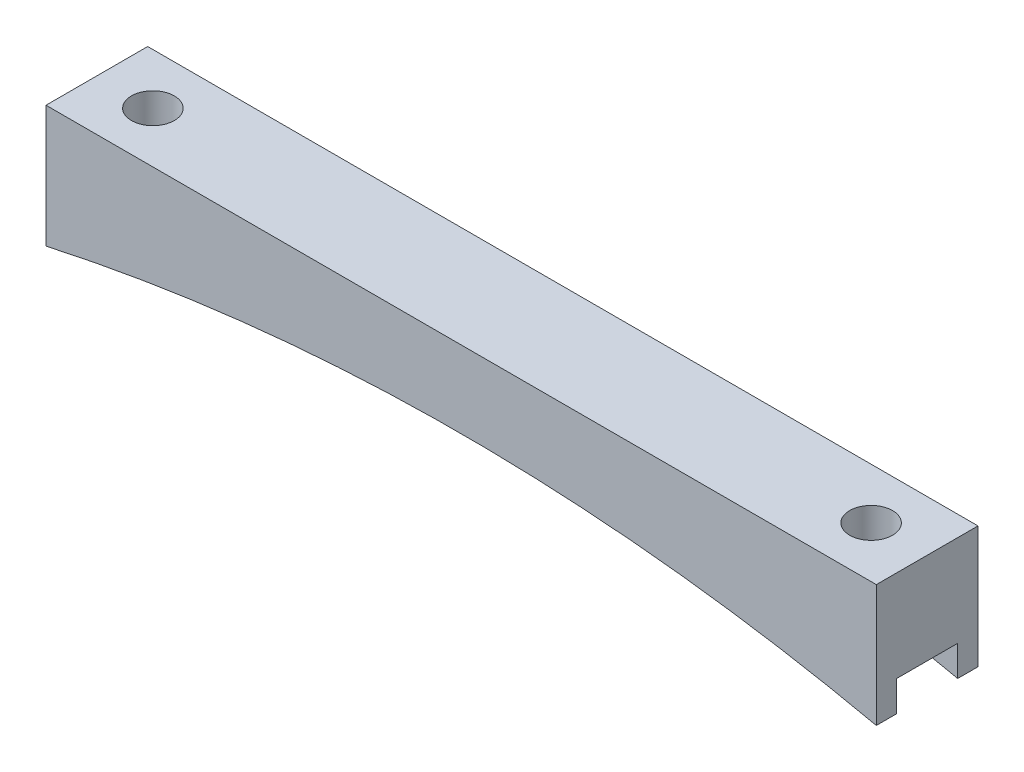
ISO-10303-21;
HEADER;
FILE_DESCRIPTION(('STEP AP214'),'2;1');
FILE_NAME('part.step','',(''),(''),'','','');
FILE_SCHEMA(('AUTOMOTIVE_DESIGN { 1 0 10303 214 1 1 1 1 }'));
ENDSEC;
DATA;
#1=APPLICATION_CONTEXT('core data for automotive mechanical design processes');
#2=APPLICATION_PROTOCOL_DEFINITION('international standard','automotive_design',2000,#1);
#3=PRODUCT_CONTEXT('',#1,'mechanical');
#4=PRODUCT('Part','Part','',(#3));
#5=PRODUCT_RELATED_PRODUCT_CATEGORY('part','',(#4));
#6=PRODUCT_DEFINITION_FORMATION('','',#4);
#7=PRODUCT_DEFINITION_CONTEXT('part definition',#1,'design');
#8=PRODUCT_DEFINITION('design','',#6,#7);
#9=PRODUCT_DEFINITION_SHAPE('','',#8);
#10=(LENGTH_UNIT() NAMED_UNIT(*) SI_UNIT(.MILLI.,.METRE.));
#11=(NAMED_UNIT(*) PLANE_ANGLE_UNIT() SI_UNIT($,.RADIAN.));
#12=(NAMED_UNIT(*) SI_UNIT($,.STERADIAN.) SOLID_ANGLE_UNIT());
#13=UNCERTAINTY_MEASURE_WITH_UNIT(LENGTH_MEASURE(1.E-05),#10,'distance_accuracy_value','');
#14=(GEOMETRIC_REPRESENTATION_CONTEXT(3) GLOBAL_UNCERTAINTY_ASSIGNED_CONTEXT((#13)) GLOBAL_UNIT_ASSIGNED_CONTEXT((#10,
#11,#12)) REPRESENTATION_CONTEXT('',''));
#15=CARTESIAN_POINT('',(0.,0.,0.));
#16=DIRECTION('',(0.,0.,1.));
#17=DIRECTION('',(1.,0.,0.));
#18=AXIS2_PLACEMENT_3D('',#15,#16,#17);
#19=CARTESIAN_POINT('',(51.855,0.,12.7));
#20=DIRECTION('',(-1.,0.,0.));
#21=DIRECTION('',(0.,0.,1.));
#22=AXIS2_PLACEMENT_3D('',#19,#20,#21);
#23=PLANE('',#22);
#24=DIRECTION('',(0.,0.,-1.));
#25=VECTOR('',#24,1.);
#26=CARTESIAN_POINT('',(51.855,-15.24,12.7));
#27=LINE('',#26,#25);
#28=CARTESIAN_POINT('',(51.855,-15.24,12.7));
#29=VERTEX_POINT('',#28);
#30=CARTESIAN_POINT('',(51.855,-15.24,10.16));
#31=VERTEX_POINT('',#30);
#32=EDGE_CURVE('E156',#29,#31,#27,.T.);
#33=ORIENTED_EDGE('',*,*,#32,.T.);
#34=DIRECTION('',(0.,-1.,0.));
#35=VECTOR('',#34,1.);
#36=CARTESIAN_POINT('',(51.855,-15.24,10.16));
#37=LINE('',#36,#35);
#38=CARTESIAN_POINT('',(51.855,-11.43,10.16));
#39=VERTEX_POINT('',#38);
#40=EDGE_CURVE('E185',#39,#31,#37,.T.);
#41=ORIENTED_EDGE('',*,*,#40,.F.);
#42=DIRECTION('',(0.,0.,1.));
#43=VECTOR('',#42,1.);
#44=CARTESIAN_POINT('',(51.855,-11.43,10.16));
#45=LINE('',#44,#43);
#46=CARTESIAN_POINT('',(51.855,-11.43,2.54));
#47=VERTEX_POINT('',#46);
#48=EDGE_CURVE('E141',#47,#39,#45,.T.);
#49=ORIENTED_EDGE('',*,*,#48,.F.);
#50=DIRECTION('',(0.,1.,0.));
#51=VECTOR('',#50,1.);
#52=CARTESIAN_POINT('',(51.855,-15.24,2.54));
#53=LINE('',#52,#51);
#54=CARTESIAN_POINT('',(51.855,-15.24,2.54));
#55=VERTEX_POINT('',#54);
#56=EDGE_CURVE('E177',#55,#47,#53,.T.);
#57=ORIENTED_EDGE('',*,*,#56,.F.);
#58=CARTESIAN_POINT('',(51.855,-15.24,0.));
#59=VERTEX_POINT('',#58);
#60=EDGE_CURVE('E174',#55,#59,#27,.T.);
#61=ORIENTED_EDGE('',*,*,#60,.T.);
#62=DIRECTION('',(0.,1.,0.));
#63=VECTOR('',#62,1.);
#64=CARTESIAN_POINT('',(51.855,0.,0.));
#65=LINE('',#64,#63);
#66=CARTESIAN_POINT('',(51.855,0.,0.));
#67=VERTEX_POINT('',#66);
#68=EDGE_CURVE('E213',#59,#67,#65,.T.);
#69=ORIENTED_EDGE('',*,*,#68,.T.);
#70=DIRECTION('',(0.,0.,-1.));
#71=VECTOR('',#70,1.);
#72=CARTESIAN_POINT('',(51.855,0.,12.7));
#73=LINE('',#72,#71);
#74=CARTESIAN_POINT('',(51.855,0.,12.7));
#75=VERTEX_POINT('',#74);
#76=EDGE_CURVE('E154',#75,#67,#73,.T.);
#77=ORIENTED_EDGE('',*,*,#76,.F.);
#78=DIRECTION('',(0.,1.,0.));
#79=VECTOR('',#78,1.);
#80=CARTESIAN_POINT('',(51.855,0.,12.7));
#81=LINE('',#80,#79);
#82=EDGE_CURVE('E217',#29,#75,#81,.T.);
#83=ORIENTED_EDGE('',*,*,#82,.F.);
#84=EDGE_LOOP('',(#33,#41,#49,#57,#61,#69,#77,#83));
#85=FACE_BOUND('',#84,.T.);
#86=ADVANCED_FACE('F43',(#85),#23,.F.);
#87=CARTESIAN_POINT('',(-51.855,0.,12.7));
#88=DIRECTION('',(0.,-1.,0.));
#89=DIRECTION('',(1.,0.,0.));
#90=AXIS2_PLACEMENT_3D('',#87,#88,#89);
#91=PLANE('',#90);
#92=CARTESIAN_POINT('',(-44.855,0.,6.35));
#93=DIRECTION('',(0.,1.,0.));
#94=DIRECTION('',(-1.,0.,0.));
#95=AXIS2_PLACEMENT_3D('',#92,#93,#94);
#96=CIRCLE('',#95,2.675);
#97=CARTESIAN_POINT('',(-47.53,0.,6.35));
#98=VERTEX_POINT('',#97);
#99=EDGE_CURVE('E209',#98,#98,#96,.T.);
#100=ORIENTED_EDGE('',*,*,#99,.F.);
#101=EDGE_LOOP('',(#100));
#102=FACE_BOUND('',#101,.T.);
#103=CARTESIAN_POINT('',(44.855,0.,6.35));
#104=DIRECTION('',(0.,1.,0.));
#105=DIRECTION('',(-1.,0.,0.));
#106=AXIS2_PLACEMENT_3D('',#103,#104,#105);
#107=CIRCLE('',#106,2.675);
#108=CARTESIAN_POINT('',(42.18,0.,6.35));
#109=VERTEX_POINT('',#108);
#110=EDGE_CURVE('E208',#109,#109,#107,.T.);
#111=ORIENTED_EDGE('',*,*,#110,.F.);
#112=EDGE_LOOP('',(#111));
#113=FACE_BOUND('',#112,.T.);
#114=DIRECTION('',(-1.,0.,0.));
#115=VECTOR('',#114,1.);
#116=CARTESIAN_POINT('',(-51.855,0.,0.));
#117=LINE('',#116,#115);
#118=CARTESIAN_POINT('',(-51.855,0.,0.));
#119=VERTEX_POINT('',#118);
#120=EDGE_CURVE('E232',#67,#119,#117,.T.);
#121=ORIENTED_EDGE('',*,*,#120,.T.);
#122=DIRECTION('',(0.,0.,-1.));
#123=VECTOR('',#122,1.);
#124=CARTESIAN_POINT('',(-51.855,0.,12.7));
#125=LINE('',#124,#123);
#126=CARTESIAN_POINT('',(-51.855,0.,12.7));
#127=VERTEX_POINT('',#126);
#128=EDGE_CURVE('E148',#127,#119,#125,.T.);
#129=ORIENTED_EDGE('',*,*,#128,.F.);
#130=DIRECTION('',(-1.,0.,0.));
#131=VECTOR('',#130,1.);
#132=CARTESIAN_POINT('',(-51.855,0.,12.7));
#133=LINE('',#132,#131);
#134=EDGE_CURVE('E221',#75,#127,#133,.T.);
#135=ORIENTED_EDGE('',*,*,#134,.F.);
#136=ORIENTED_EDGE('',*,*,#76,.T.);
#137=EDGE_LOOP('',(#121,#129,#135,#136));
#138=FACE_BOUND('',#137,.T.);
#139=ADVANCED_FACE('F247',(#102,#113,#138),#91,.F.);
#140=CARTESIAN_POINT('',(-51.855,0.,12.7));
#141=DIRECTION('',(1.,0.,0.));
#142=DIRECTION('',(0.,0.,-1.));
#143=AXIS2_PLACEMENT_3D('',#140,#141,#142);
#144=PLANE('',#143);
#145=DIRECTION('',(0.,0.,1.));
#146=VECTOR('',#145,1.);
#147=CARTESIAN_POINT('',(-51.855,-11.43,10.16));
#148=LINE('',#147,#146);
#149=CARTESIAN_POINT('',(-51.855,-11.43,2.54));
#150=VERTEX_POINT('',#149);
#151=CARTESIAN_POINT('',(-51.855,-11.43,10.16));
#152=VERTEX_POINT('',#151);
#153=EDGE_CURVE('E139',#150,#152,#148,.T.);
#154=ORIENTED_EDGE('',*,*,#153,.T.);
#155=DIRECTION('',(0.,-1.,0.));
#156=VECTOR('',#155,1.);
#157=CARTESIAN_POINT('',(-51.855,-15.24,10.16));
#158=LINE('',#157,#156);
#159=CARTESIAN_POINT('',(-51.855,-15.24,10.16));
#160=VERTEX_POINT('',#159);
#161=EDGE_CURVE('E124',#152,#160,#158,.T.);
#162=ORIENTED_EDGE('',*,*,#161,.T.);
#163=DIRECTION('',(0.,0.,-1.));
#164=VECTOR('',#163,1.);
#165=CARTESIAN_POINT('',(-51.855,-15.24,12.7));
#166=LINE('',#165,#164);
#167=CARTESIAN_POINT('',(-51.855,-15.24,12.7));
#168=VERTEX_POINT('',#167);
#169=EDGE_CURVE('E136',#168,#160,#166,.T.);
#170=ORIENTED_EDGE('',*,*,#169,.F.);
#171=DIRECTION('',(0.,-1.,0.));
#172=VECTOR('',#171,1.);
#173=CARTESIAN_POINT('',(-51.855,0.,12.7));
#174=LINE('',#173,#172);
#175=EDGE_CURVE('E225',#127,#168,#174,.T.);
#176=ORIENTED_EDGE('',*,*,#175,.F.);
#177=ORIENTED_EDGE('',*,*,#128,.T.);
#178=DIRECTION('',(0.,-1.,0.));
#179=VECTOR('',#178,1.);
#180=CARTESIAN_POINT('',(-51.855,0.,0.));
#181=LINE('',#180,#179);
#182=CARTESIAN_POINT('',(-51.855,-15.24,0.));
#183=VERTEX_POINT('',#182);
#184=EDGE_CURVE('E235',#119,#183,#181,.T.);
#185=ORIENTED_EDGE('',*,*,#184,.T.);
#186=CARTESIAN_POINT('',(-51.855,-15.24,2.54));
#187=VERTEX_POINT('',#186);
#188=EDGE_CURVE('E149',#187,#183,#166,.T.);
#189=ORIENTED_EDGE('',*,*,#188,.F.);
#190=DIRECTION('',(0.,1.,0.));
#191=VECTOR('',#190,1.);
#192=CARTESIAN_POINT('',(-51.855,-15.24,2.54));
#193=LINE('',#192,#191);
#194=EDGE_CURVE('E67',#187,#150,#193,.T.);
#195=ORIENTED_EDGE('',*,*,#194,.T.);
#196=EDGE_LOOP('',(#154,#162,#170,#176,#177,#185,#189,#195));
#197=FACE_BOUND('',#196,.T.);
#198=ADVANCED_FACE('F134',(#197),#144,.F.);
#199=CARTESIAN_POINT('',(0.,-250.902362236739,12.7));
#200=DIRECTION('',(0.,0.,-1.));
#201=DIRECTION('',(-1.,0.,0.));
#202=AXIS2_PLACEMENT_3D('',#199,#200,#201);
#203=CYLINDRICAL_SURFACE('',#202,241.3);
#204=DIRECTION('',(0.,0.,-1.));
#205=VECTOR('',#204,1.);
#206=CARTESIAN_POINT('',(29.6424986253866,-11.43,12.7));
#207=LINE('',#206,#205);
#208=CARTESIAN_POINT('',(29.6424986253866,-11.43,2.54));
#209=VERTEX_POINT('',#208);
#210=CARTESIAN_POINT('',(29.6424986253866,-11.43,10.16));
#211=VERTEX_POINT('',#210);
#212=EDGE_CURVE('E172',#209,#211,#207,.F.);
#213=ORIENTED_EDGE('',*,*,#212,.T.);
#214=CARTESIAN_POINT('',(0.,-250.902362236739,10.16));
#215=DIRECTION('',(0.,0.,1.));
#216=DIRECTION('',(1.,0.,0.));
#217=AXIS2_PLACEMENT_3D('',#214,#215,#216);
#218=CIRCLE('',#217,241.3);
#219=EDGE_CURVE('E11',#211,#31,#218,.F.);
#220=ORIENTED_EDGE('',*,*,#219,.T.);
#221=ORIENTED_EDGE('',*,*,#32,.F.);
#222=CARTESIAN_POINT('',(0.,-250.902362236739,12.7));
#223=DIRECTION('',(0.,0.,-1.));
#224=DIRECTION('',(-1.,0.,0.));
#225=AXIS2_PLACEMENT_3D('',#222,#223,#224);
#226=CIRCLE('',#225,241.3);
#227=EDGE_CURVE('E146',#168,#29,#226,.T.);
#228=ORIENTED_EDGE('',*,*,#227,.F.);
#229=ORIENTED_EDGE('',*,*,#169,.T.);
#230=CARTESIAN_POINT('',(-29.6424986253866,-11.43,10.16));
#231=VERTEX_POINT('',#230);
#232=EDGE_CURVE('E46',#160,#231,#218,.F.);
#233=ORIENTED_EDGE('',*,*,#232,.T.);
#234=DIRECTION('',(0.,0.,-1.));
#235=VECTOR('',#234,1.);
#236=CARTESIAN_POINT('',(-29.6424986253866,-11.43,12.7));
#237=LINE('',#236,#235);
#238=CARTESIAN_POINT('',(-29.6424986253866,-11.43,2.54));
#239=VERTEX_POINT('',#238);
#240=EDGE_CURVE('E203',#231,#239,#237,.T.);
#241=ORIENTED_EDGE('',*,*,#240,.T.);
#242=CARTESIAN_POINT('',(0.,-250.902362236739,2.54));
#243=DIRECTION('',(0.,0.,-1.));
#244=DIRECTION('',(-1.,0.,0.));
#245=AXIS2_PLACEMENT_3D('',#242,#243,#244);
#246=CIRCLE('',#245,241.3);
#247=EDGE_CURVE('E131',#239,#187,#246,.F.);
#248=ORIENTED_EDGE('',*,*,#247,.T.);
#249=ORIENTED_EDGE('',*,*,#188,.T.);
#250=CARTESIAN_POINT('',(0.,-250.902362236739,0.));
#251=DIRECTION('',(0.,0.,-1.));
#252=DIRECTION('',(-1.,0.,0.));
#253=AXIS2_PLACEMENT_3D('',#250,#251,#252);
#254=CIRCLE('',#253,241.3);
#255=EDGE_CURVE('E222',#183,#59,#254,.T.);
#256=ORIENTED_EDGE('',*,*,#255,.T.);
#257=ORIENTED_EDGE('',*,*,#60,.F.);
#258=EDGE_CURVE('E52',#55,#209,#246,.F.);
#259=ORIENTED_EDGE('',*,*,#258,.T.);
#260=EDGE_LOOP('',(#213,#220,#221,#228,#229,#233,#241,#248,#249,#256,#257,#259));
#261=FACE_BOUND('',#260,.T.);
#262=ADVANCED_FACE('F144',(#261),#203,.F.);
#263=CARTESIAN_POINT('',(0.,-250.902362236739,12.7));
#264=DIRECTION('',(0.,0.,-1.));
#265=DIRECTION('',(-1.,0.,0.));
#266=AXIS2_PLACEMENT_3D('',#263,#264,#265);
#267=PLANE('',#266);
#268=ORIENTED_EDGE('',*,*,#82,.T.);
#269=ORIENTED_EDGE('',*,*,#134,.T.);
#270=ORIENTED_EDGE('',*,*,#175,.T.);
#271=ORIENTED_EDGE('',*,*,#227,.T.);
#272=EDGE_LOOP('',(#268,#269,#270,#271));
#273=FACE_BOUND('',#272,.T.);
#274=ADVANCED_FACE('F250',(#273),#267,.F.);
#275=CARTESIAN_POINT('',(0.,-250.902362236739,0.));
#276=DIRECTION('',(0.,0.,-1.));
#277=DIRECTION('',(-1.,0.,0.));
#278=AXIS2_PLACEMENT_3D('',#275,#276,#277);
#279=PLANE('',#278);
#280=ORIENTED_EDGE('',*,*,#68,.F.);
#281=ORIENTED_EDGE('',*,*,#255,.F.);
#282=ORIENTED_EDGE('',*,*,#184,.F.);
#283=ORIENTED_EDGE('',*,*,#120,.F.);
#284=EDGE_LOOP('',(#280,#281,#282,#283));
#285=FACE_BOUND('',#284,.T.);
#286=ADVANCED_FACE('F243',(#285),#279,.T.);
#287=CARTESIAN_POINT('',(44.855,-15.24,6.35));
#288=DIRECTION('',(0.,1.,0.));
#289=DIRECTION('',(-1.,0.,0.));
#290=AXIS2_PLACEMENT_3D('',#287,#288,#289);
#291=CYLINDRICAL_SURFACE('',#290,2.675);
#292=CARTESIAN_POINT('',(44.855,-11.43,6.35));
#293=DIRECTION('',(0.,1.,0.));
#294=DIRECTION('',(0.,0.,1.));
#295=AXIS2_PLACEMENT_3D('',#292,#293,#294);
#296=CIRCLE('',#295,2.675);
#297=CARTESIAN_POINT('',(44.855,-11.43,9.025));
#298=VERTEX_POINT('',#297);
#299=EDGE_CURVE('E166',#298,#298,#296,.F.);
#300=ORIENTED_EDGE('',*,*,#299,.T.);
#301=EDGE_LOOP('',(#300));
#302=FACE_BOUND('',#301,.T.);
#303=ORIENTED_EDGE('',*,*,#110,.T.);
#304=EDGE_LOOP('',(#303));
#305=FACE_BOUND('',#304,.T.);
#306=ADVANCED_FACE('F292',(#302,#305),#291,.F.);
#307=CARTESIAN_POINT('',(-44.855,-15.24,6.35));
#308=DIRECTION('',(0.,1.,0.));
#309=DIRECTION('',(-1.,0.,0.));
#310=AXIS2_PLACEMENT_3D('',#307,#308,#309);
#311=CYLINDRICAL_SURFACE('',#310,2.675);
#312=CARTESIAN_POINT('',(-44.855,-11.43,6.35));
#313=DIRECTION('',(0.,1.,0.));
#314=DIRECTION('',(0.,0.,1.));
#315=AXIS2_PLACEMENT_3D('',#312,#313,#314);
#316=CIRCLE('',#315,2.675);
#317=CARTESIAN_POINT('',(-44.855,-11.43,9.025));
#318=VERTEX_POINT('',#317);
#319=EDGE_CURVE('E163',#318,#318,#316,.F.);
#320=ORIENTED_EDGE('',*,*,#319,.T.);
#321=EDGE_LOOP('',(#320));
#322=FACE_BOUND('',#321,.T.);
#323=ORIENTED_EDGE('',*,*,#99,.T.);
#324=EDGE_LOOP('',(#323));
#325=FACE_BOUND('',#324,.T.);
#326=ADVANCED_FACE('F274',(#322,#325),#311,.F.);
#327=CARTESIAN_POINT('',(-51.855,-11.43,10.16));
#328=DIRECTION('',(0.,1.,0.));
#329=DIRECTION('',(0.,0.,1.));
#330=AXIS2_PLACEMENT_3D('',#327,#328,#329);
#331=PLANE('',#330);
#332=ORIENTED_EDGE('',*,*,#319,.F.);
#333=EDGE_LOOP('',(#332));
#334=FACE_BOUND('',#333,.T.);
#335=DIRECTION('',(1.,0.,0.));
#336=VECTOR('',#335,1.);
#337=CARTESIAN_POINT('',(-51.855,-11.43,10.16));
#338=LINE('',#337,#336);
#339=EDGE_CURVE('E126',#152,#231,#338,.T.);
#340=ORIENTED_EDGE('',*,*,#339,.F.);
#341=ORIENTED_EDGE('',*,*,#153,.F.);
#342=DIRECTION('',(1.,0.,0.));
#343=VECTOR('',#342,1.);
#344=CARTESIAN_POINT('',(-51.855,-11.43,2.54));
#345=LINE('',#344,#343);
#346=EDGE_CURVE('E196',#150,#239,#345,.T.);
#347=ORIENTED_EDGE('',*,*,#346,.T.);
#348=ORIENTED_EDGE('',*,*,#240,.F.);
#349=EDGE_LOOP('',(#340,#341,#347,#348));
#350=FACE_BOUND('',#349,.T.);
#351=ADVANCED_FACE('F266',(#334,#350),#331,.F.);
#352=CARTESIAN_POINT('',(-51.855,-15.24,2.54));
#353=DIRECTION('',(0.,0.,-1.));
#354=DIRECTION('',(-1.,0.,0.));
#355=AXIS2_PLACEMENT_3D('',#352,#353,#354);
#356=PLANE('',#355);
#357=ORIENTED_EDGE('',*,*,#346,.F.);
#358=ORIENTED_EDGE('',*,*,#194,.F.);
#359=ORIENTED_EDGE('',*,*,#247,.F.);
#360=EDGE_LOOP('',(#357,#358,#359));
#361=FACE_BOUND('',#360,.T.);
#362=ADVANCED_FACE('F271',(#361),#356,.F.);
#363=CARTESIAN_POINT('',(-51.855,-15.24,10.16));
#364=DIRECTION('',(0.,0.,1.));
#365=DIRECTION('',(1.,0.,0.));
#366=AXIS2_PLACEMENT_3D('',#363,#364,#365);
#367=PLANE('',#366);
#368=ORIENTED_EDGE('',*,*,#161,.F.);
#369=ORIENTED_EDGE('',*,*,#339,.T.);
#370=ORIENTED_EDGE('',*,*,#232,.F.);
#371=EDGE_LOOP('',(#368,#369,#370));
#372=FACE_BOUND('',#371,.T.);
#373=ADVANCED_FACE('F123',(#372),#367,.F.);
#374=EDGE_CURVE('E195',#211,#39,#338,.T.);
#375=ORIENTED_EDGE('',*,*,#374,.T.);
#376=ORIENTED_EDGE('',*,*,#40,.T.);
#377=ORIENTED_EDGE('',*,*,#219,.F.);
#378=EDGE_LOOP('',(#375,#376,#377));
#379=FACE_BOUND('',#378,.T.);
#380=ADVANCED_FACE('F254',(#379),#367,.F.);
#381=ORIENTED_EDGE('',*,*,#56,.T.);
#382=EDGE_CURVE('E59',#209,#47,#345,.T.);
#383=ORIENTED_EDGE('',*,*,#382,.F.);
#384=ORIENTED_EDGE('',*,*,#258,.F.);
#385=EDGE_LOOP('',(#381,#383,#384));
#386=FACE_BOUND('',#385,.T.);
#387=ADVANCED_FACE('F176',(#386),#356,.F.);
#388=ORIENTED_EDGE('',*,*,#299,.F.);
#389=EDGE_LOOP('',(#388));
#390=FACE_BOUND('',#389,.T.);
#391=ORIENTED_EDGE('',*,*,#382,.T.);
#392=ORIENTED_EDGE('',*,*,#48,.T.);
#393=ORIENTED_EDGE('',*,*,#374,.F.);
#394=ORIENTED_EDGE('',*,*,#212,.F.);
#395=EDGE_LOOP('',(#391,#392,#393,#394));
#396=FACE_BOUND('',#395,.T.);
#397=ADVANCED_FACE('F258',(#390,#396),#331,.F.);
#398=CLOSED_SHELL('',(#86,#139,#198,#262,#274,#286,#306,#326,#351,#362,#373,#380,#387,#397));
#399=MANIFOLD_SOLID_BREP('B2',#398);
#400=ADVANCED_BREP_SHAPE_REPRESENTATION('',(#18,#399),#14);
#401=SHAPE_DEFINITION_REPRESENTATION(#9,#400);
ENDSEC;
END-ISO-10303-21;
